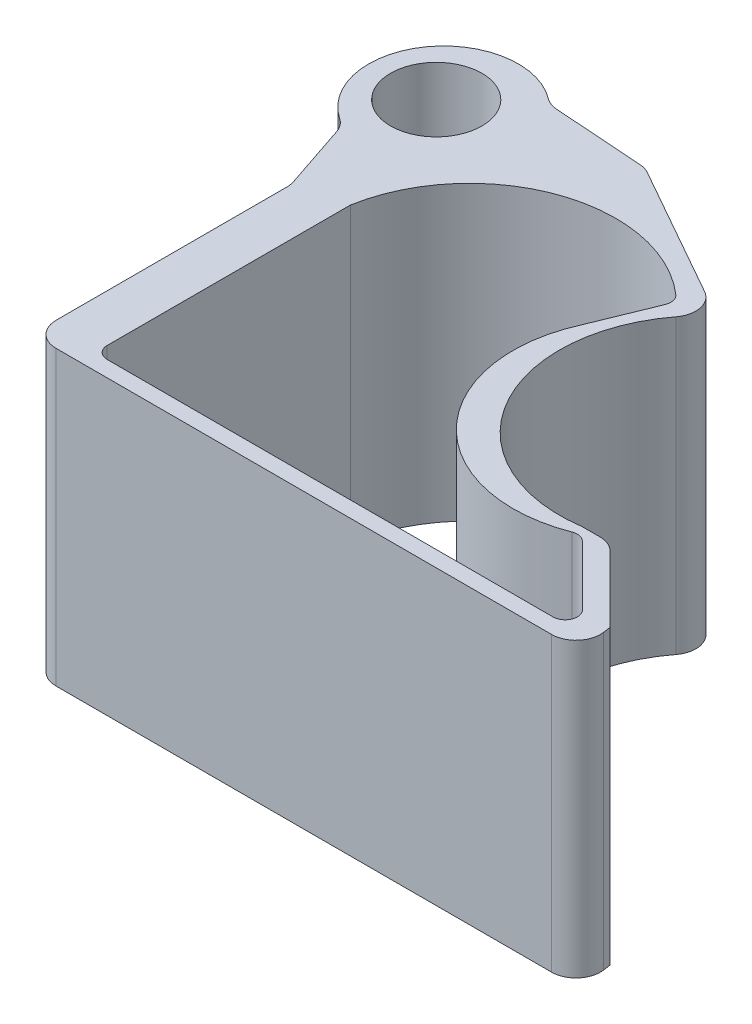
ISO-10303-21;
HEADER;
FILE_DESCRIPTION(('STEP AP214'),'2;1');
FILE_NAME('part.step','',(''),(''),'','','');
FILE_SCHEMA(('AUTOMOTIVE_DESIGN { 1 0 10303 214 1 1 1 1 }'));
ENDSEC;
DATA;
#1=APPLICATION_CONTEXT('core data for automotive mechanical design processes');
#2=APPLICATION_PROTOCOL_DEFINITION('international standard','automotive_design',2000,#1);
#3=PRODUCT_CONTEXT('',#1,'mechanical');
#4=PRODUCT('Part','Part','',(#3));
#5=PRODUCT_RELATED_PRODUCT_CATEGORY('part','',(#4));
#6=PRODUCT_DEFINITION_FORMATION('','',#4);
#7=PRODUCT_DEFINITION_CONTEXT('part definition',#1,'design');
#8=PRODUCT_DEFINITION('design','',#6,#7);
#9=PRODUCT_DEFINITION_SHAPE('','',#8);
#10=(LENGTH_UNIT() NAMED_UNIT(*) SI_UNIT(.MILLI.,.METRE.));
#11=(NAMED_UNIT(*) PLANE_ANGLE_UNIT() SI_UNIT($,.RADIAN.));
#12=(NAMED_UNIT(*) SI_UNIT($,.STERADIAN.) SOLID_ANGLE_UNIT());
#13=UNCERTAINTY_MEASURE_WITH_UNIT(LENGTH_MEASURE(1.E-05),#10,'distance_accuracy_value','');
#14=(GEOMETRIC_REPRESENTATION_CONTEXT(3) GLOBAL_UNCERTAINTY_ASSIGNED_CONTEXT((#13)) GLOBAL_UNIT_ASSIGNED_CONTEXT((#10,
#11,#12)) REPRESENTATION_CONTEXT('',''));
#15=CARTESIAN_POINT('',(0.,0.,0.));
#16=DIRECTION('',(0.,0.,1.));
#17=DIRECTION('',(1.,0.,0.));
#18=AXIS2_PLACEMENT_3D('',#15,#16,#17);
#19=CARTESIAN_POINT('',(4.18471702720005,30.48,1.7044667519984));
#20=DIRECTION('',(-0.926124676903562,0.,-0.377217553714397));
#21=DIRECTION('',(-0.377217553714397,0.,0.926124676903562));
#22=AXIS2_PLACEMENT_3D('',#19,#20,#21);
#23=PLANE('',#22);
#24=DIRECTION('',(0.377217553714397,0.,-0.926124676903562));
#25=VECTOR('',#24,1.);
#26=CARTESIAN_POINT('',(4.18471702720005,0.,1.7044667519984));
#27=LINE('',#26,#25);
#28=CARTESIAN_POINT('',(16.2026689249602,0.,-27.8013759871829));
#29=VERTEX_POINT('',#28);
#30=CARTESIAN_POINT('',(18.7462308393611,0.,-34.0461952777038));
#31=VERTEX_POINT('',#30);
#32=EDGE_CURVE('E337',#29,#31,#27,.T.);
#33=ORIENTED_EDGE('',*,*,#32,.F.);
#34=DIRECTION('',(0.,-1.,0.));
#35=VECTOR('',#34,1.);
#36=CARTESIAN_POINT('',(16.2026689249602,30.48,-27.8013759871829));
#37=LINE('',#36,#35);
#38=CARTESIAN_POINT('',(16.2026689249602,30.48,-27.8013759871829));
#39=VERTEX_POINT('',#38);
#40=EDGE_CURVE('E386',#39,#29,#37,.T.);
#41=ORIENTED_EDGE('',*,*,#40,.F.);
#42=DIRECTION('',(0.377217553714397,0.,-0.926124676903562));
#43=VECTOR('',#42,1.);
#44=CARTESIAN_POINT('',(4.18471702720005,30.48,1.7044667519984));
#45=LINE('',#44,#43);
#46=CARTESIAN_POINT('',(18.7462308393611,30.48,-34.0461952777038));
#47=VERTEX_POINT('',#46);
#48=EDGE_CURVE('E281',#39,#47,#45,.T.);
#49=ORIENTED_EDGE('',*,*,#48,.T.);
#50=DIRECTION('',(0.,-1.,0.));
#51=VECTOR('',#50,1.);
#52=CARTESIAN_POINT('',(18.7462308393611,30.48,-34.0461952777038));
#53=LINE('',#52,#51);
#54=EDGE_CURVE('E236',#47,#31,#53,.T.);
#55=ORIENTED_EDGE('',*,*,#54,.T.);
#56=EDGE_LOOP('',(#33,#41,#49,#55));
#57=FACE_BOUND('',#56,.T.);
#58=ADVANCED_FACE('F38',(#57),#23,.T.);
#59=CARTESIAN_POINT('',(29.2464173163576,30.48,-21.971));
#60=DIRECTION('',(0.,-1.,0.));
#61=DIRECTION('',(0.,0.,-1.));
#62=AXIS2_PLACEMENT_3D('',#59,#60,#61);
#63=CYLINDRICAL_SURFACE('',#62,14.2875);
#64=CARTESIAN_POINT('',(29.2464173163576,0.,-21.971));
#65=DIRECTION('',(0.,1.,0.));
#66=DIRECTION('',(0.,0.,1.));
#67=AXIS2_PLACEMENT_3D('',#64,#65,#66);
#68=CIRCLE('',#67,14.2875);
#69=CARTESIAN_POINT('',(34.4186080856135,0.,-8.65255043196006));
#70=VERTEX_POINT('',#69);
#71=EDGE_CURVE('E340',#29,#70,#68,.T.);
#72=ORIENTED_EDGE('',*,*,#71,.T.);
#73=DIRECTION('',(0.,-1.,0.));
#74=VECTOR('',#73,1.);
#75=CARTESIAN_POINT('',(34.4186080856135,30.48,-8.65255043196006));
#76=LINE('',#75,#74);
#77=CARTESIAN_POINT('',(34.4186080856135,30.48,-8.65255043196006));
#78=VERTEX_POINT('',#77);
#79=EDGE_CURVE('E383',#78,#70,#76,.T.);
#80=ORIENTED_EDGE('',*,*,#79,.F.);
#81=CARTESIAN_POINT('',(29.2464173163576,30.48,-21.971));
#82=DIRECTION('',(0.,1.,0.));
#83=DIRECTION('',(0.,0.,1.));
#84=AXIS2_PLACEMENT_3D('',#81,#82,#83);
#85=CIRCLE('',#84,14.2875);
#86=EDGE_CURVE('E284',#39,#78,#85,.T.);
#87=ORIENTED_EDGE('',*,*,#86,.F.);
#88=ORIENTED_EDGE('',*,*,#40,.T.);
#89=EDGE_LOOP('',(#72,#80,#87,#88));
#90=FACE_BOUND('',#89,.T.);
#91=ADVANCED_FACE('F488',(#90),#63,.T.);
#92=CARTESIAN_POINT('',(34.878358376214,30.48,-7.46868824813428));
#93=DIRECTION('',(0.,-1.,0.));
#94=DIRECTION('',(0.,0.,-1.));
#95=AXIS2_PLACEMENT_3D('',#92,#93,#94);
#96=CYLINDRICAL_SURFACE('',#95,1.27000000000001);
#97=CARTESIAN_POINT('',(34.878358376214,0.,-7.46868824813428));
#98=DIRECTION('',(0.,1.,0.));
#99=DIRECTION('',(0.,0.,1.));
#100=AXIS2_PLACEMENT_3D('',#97,#98,#99);
#101=CIRCLE('',#100,1.27000000000001);
#102=CARTESIAN_POINT('',(35.7753654293317,0.,-8.36773126526816));
#103=VERTEX_POINT('',#102);
#104=EDGE_CURVE('E343',#70,#103,#101,.F.);
#105=ORIENTED_EDGE('',*,*,#104,.T.);
#106=DIRECTION('',(0.,-1.,0.));
#107=VECTOR('',#106,1.);
#108=CARTESIAN_POINT('',(35.7753654293317,30.48,-8.36773126526816));
#109=LINE('',#108,#107);
#110=CARTESIAN_POINT('',(35.7753654293317,30.48,-8.36773126526816));
#111=VERTEX_POINT('',#110);
#112=EDGE_CURVE('E380',#111,#103,#109,.T.);
#113=ORIENTED_EDGE('',*,*,#112,.F.);
#114=CARTESIAN_POINT('',(34.878358376214,30.48,-7.46868824813428));
#115=DIRECTION('',(0.,1.,0.));
#116=DIRECTION('',(0.,0.,1.));
#117=AXIS2_PLACEMENT_3D('',#114,#115,#116);
#118=CIRCLE('',#117,1.27000000000001);
#119=EDGE_CURVE('E287',#78,#111,#118,.F.);
#120=ORIENTED_EDGE('',*,*,#119,.F.);
#121=ORIENTED_EDGE('',*,*,#79,.T.);
#122=EDGE_LOOP('',(#105,#113,#120,#121));
#123=FACE_BOUND('',#122,.T.);
#124=ADVANCED_FACE('F494',(#123),#96,.F.);
#125=CARTESIAN_POINT('',(22.0309834563949,30.48,-22.0809878453274));
#126=DIRECTION('',(0.706304766234372,0.,-0.70790788750699));
#127=DIRECTION('',(-0.70790788750699,0.,-0.706304766234372));
#128=AXIS2_PLACEMENT_3D('',#125,#126,#127);
#129=PLANE('',#128);
#130=DIRECTION('',(0.70790788750699,0.,0.706304766234372));
#131=VECTOR('',#130,1.);
#132=CARTESIAN_POINT('',(22.0309834563949,0.,-22.0809878453274));
#133=LINE('',#132,#131);
#134=CARTESIAN_POINT('',(41.9881230275086,0.,-2.16904301713387));
#135=VERTEX_POINT('',#134);
#136=EDGE_CURVE('E346',#103,#135,#133,.T.);
#137=ORIENTED_EDGE('',*,*,#136,.T.);
#138=DIRECTION('',(0.,-1.,0.));
#139=VECTOR('',#138,1.);
#140=CARTESIAN_POINT('',(41.9881230275086,30.48,-2.16904301713387));
#141=LINE('',#140,#139);
#142=CARTESIAN_POINT('',(41.9881230275086,30.48,-2.16904301713387));
#143=VERTEX_POINT('',#142);
#144=EDGE_CURVE('E377',#143,#135,#141,.T.);
#145=ORIENTED_EDGE('',*,*,#144,.F.);
#146=DIRECTION('',(0.70790788750699,0.,0.706304766234372));
#147=VECTOR('',#146,1.);
#148=CARTESIAN_POINT('',(22.0309834563949,30.48,-22.0809878453274));
#149=LINE('',#148,#147);
#150=EDGE_CURVE('E290',#111,#143,#149,.T.);
#151=ORIENTED_EDGE('',*,*,#150,.F.);
#152=ORIENTED_EDGE('',*,*,#112,.T.);
#153=EDGE_LOOP('',(#137,#145,#151,#152));
#154=FACE_BOUND('',#153,.T.);
#155=ADVANCED_FACE('F771',(#154),#129,.F.);
#156=CARTESIAN_POINT('',(41.0911159743909,30.48,-1.27000000000001));
#157=DIRECTION('',(0.,-1.,0.));
#158=DIRECTION('',(0.,0.,-1.));
#159=AXIS2_PLACEMENT_3D('',#156,#157,#158);
#160=CYLINDRICAL_SURFACE('',#159,1.27);
#161=CARTESIAN_POINT('',(41.0911159743909,0.,-1.27000000000001));
#162=DIRECTION('',(0.,1.,0.));
#163=DIRECTION('',(0.,0.,1.));
#164=AXIS2_PLACEMENT_3D('',#161,#162,#163);
#165=CIRCLE('',#164,1.27);
#166=CARTESIAN_POINT('',(41.0911159743909,0.,0.));
#167=VERTEX_POINT('',#166);
#168=EDGE_CURVE('E349',#135,#167,#165,.F.);
#169=ORIENTED_EDGE('',*,*,#168,.T.);
#170=DIRECTION('',(0.,-1.,0.));
#171=VECTOR('',#170,1.);
#172=CARTESIAN_POINT('',(41.0911159743909,30.48,0.));
#173=LINE('',#172,#171);
#174=CARTESIAN_POINT('',(41.0911159743909,30.48,0.));
#175=VERTEX_POINT('',#174);
#176=EDGE_CURVE('E374',#175,#167,#173,.T.);
#177=ORIENTED_EDGE('',*,*,#176,.F.);
#178=CARTESIAN_POINT('',(41.0911159743909,30.48,-1.27000000000001));
#179=DIRECTION('',(0.,1.,0.));
#180=DIRECTION('',(0.,0.,1.));
#181=AXIS2_PLACEMENT_3D('',#178,#179,#180);
#182=CIRCLE('',#181,1.27);
#183=EDGE_CURVE('E293',#143,#175,#182,.F.);
#184=ORIENTED_EDGE('',*,*,#183,.F.);
#185=ORIENTED_EDGE('',*,*,#144,.T.);
#186=EDGE_LOOP('',(#169,#177,#184,#185));
#187=FACE_BOUND('',#186,.T.);
#188=ADVANCED_FACE('F763',(#187),#160,.F.);
#189=CARTESIAN_POINT('',(0.,30.48,0.));
#190=DIRECTION('',(0.,0.,1.));
#191=DIRECTION('',(1.,0.,0.));
#192=AXIS2_PLACEMENT_3D('',#189,#190,#191);
#193=PLANE('',#192);
#194=DIRECTION('',(-1.,0.,0.));
#195=VECTOR('',#194,1.);
#196=CARTESIAN_POINT('',(0.,0.,0.));
#197=LINE('',#196,#195);
#198=CARTESIAN_POINT('',(-5.36791081287254,0.,0.));
#199=VERTEX_POINT('',#198);
#200=EDGE_CURVE('E352',#167,#199,#197,.T.);
#201=ORIENTED_EDGE('',*,*,#200,.T.);
#202=DIRECTION('',(0.,-1.,0.));
#203=VECTOR('',#202,1.);
#204=CARTESIAN_POINT('',(-5.36791081287254,30.48,0.));
#205=LINE('',#204,#203);
#206=CARTESIAN_POINT('',(-5.36791081287254,30.48,0.));
#207=VERTEX_POINT('',#206);
#208=EDGE_CURVE('E372',#207,#199,#205,.T.);
#209=ORIENTED_EDGE('',*,*,#208,.F.);
#210=DIRECTION('',(-1.,0.,0.));
#211=VECTOR('',#210,1.);
#212=CARTESIAN_POINT('',(0.,30.48,0.));
#213=LINE('',#212,#211);
#214=EDGE_CURVE('E296',#175,#207,#213,.T.);
#215=ORIENTED_EDGE('',*,*,#214,.F.);
#216=ORIENTED_EDGE('',*,*,#176,.T.);
#217=EDGE_LOOP('',(#201,#209,#215,#216));
#218=FACE_BOUND('',#217,.T.);
#219=ADVANCED_FACE('F755',(#218),#193,.F.);
#220=CARTESIAN_POINT('',(-5.36791081287255,30.48,-1.27000000000001));
#221=DIRECTION('',(0.,-1.,0.));
#222=DIRECTION('',(0.,0.,-1.));
#223=AXIS2_PLACEMENT_3D('',#220,#221,#222);
#224=CYLINDRICAL_SURFACE('',#223,1.27);
#225=CARTESIAN_POINT('',(-5.36791081287255,0.,-1.27000000000001));
#226=DIRECTION('',(0.,1.,0.));
#227=DIRECTION('',(0.,0.,1.));
#228=AXIS2_PLACEMENT_3D('',#225,#226,#227);
#229=CIRCLE('',#228,1.27);
#230=CARTESIAN_POINT('',(-6.63791081287255,0.,-1.27));
#231=VERTEX_POINT('',#230);
#232=EDGE_CURVE('E355',#231,#199,#229,.T.);
#233=ORIENTED_EDGE('',*,*,#232,.F.);
#234=DIRECTION('',(0.,-1.,0.));
#235=VECTOR('',#234,1.);
#236=CARTESIAN_POINT('',(-6.63791081287255,30.48,-1.27));
#237=LINE('',#236,#235);
#238=CARTESIAN_POINT('',(-6.63791081287255,30.48,-1.27));
#239=VERTEX_POINT('',#238);
#240=EDGE_CURVE('E370',#239,#231,#237,.T.);
#241=ORIENTED_EDGE('',*,*,#240,.F.);
#242=CARTESIAN_POINT('',(-5.36791081287255,30.48,-1.27000000000001));
#243=DIRECTION('',(0.,1.,0.));
#244=DIRECTION('',(0.,0.,1.));
#245=AXIS2_PLACEMENT_3D('',#242,#243,#244);
#246=CIRCLE('',#245,1.27);
#247=EDGE_CURVE('E298',#239,#207,#246,.T.);
#248=ORIENTED_EDGE('',*,*,#247,.T.);
#249=ORIENTED_EDGE('',*,*,#208,.T.);
#250=EDGE_LOOP('',(#233,#241,#248,#249));
#251=FACE_BOUND('',#250,.T.);
#252=ADVANCED_FACE('F747',(#251),#224,.F.);
#253=CARTESIAN_POINT('',(-6.63791081287255,30.48,0.));
#254=DIRECTION('',(-1.,0.,0.));
#255=DIRECTION('',(0.,0.,1.));
#256=AXIS2_PLACEMENT_3D('',#253,#254,#255);
#257=PLANE('',#256);
#258=DIRECTION('',(0.,0.,-1.));
#259=VECTOR('',#258,1.);
#260=CARTESIAN_POINT('',(-6.63791081287255,0.,0.));
#261=LINE('',#260,#259);
#262=CARTESIAN_POINT('',(-6.63791081287255,0.,-26.6076118719117));
#263=VERTEX_POINT('',#262);
#264=EDGE_CURVE('E358',#231,#263,#261,.T.);
#265=ORIENTED_EDGE('',*,*,#264,.T.);
#266=DIRECTION('',(0.,-1.,0.));
#267=VECTOR('',#266,1.);
#268=CARTESIAN_POINT('',(-6.63791081287255,30.48,-26.6076118719117));
#269=LINE('',#268,#267);
#270=CARTESIAN_POINT('',(-6.63791081287255,30.48,-26.6076118719117));
#271=VERTEX_POINT('',#270);
#272=EDGE_CURVE('E367',#271,#263,#269,.T.);
#273=ORIENTED_EDGE('',*,*,#272,.F.);
#274=DIRECTION('',(0.,0.,-1.));
#275=VECTOR('',#274,1.);
#276=CARTESIAN_POINT('',(-6.63791081287255,30.48,0.));
#277=LINE('',#276,#275);
#278=EDGE_CURVE('E301',#239,#271,#277,.T.);
#279=ORIENTED_EDGE('',*,*,#278,.F.);
#280=ORIENTED_EDGE('',*,*,#240,.T.);
#281=EDGE_LOOP('',(#265,#273,#279,#280));
#282=FACE_BOUND('',#281,.T.);
#283=ADVANCED_FACE('F740',(#282),#257,.F.);
#284=CARTESIAN_POINT('',(8.37824924748507,30.48,-24.0052020191556));
#285=DIRECTION('',(0.,-1.,0.));
#286=DIRECTION('',(0.,0.,-1.));
#287=AXIS2_PLACEMENT_3D('',#284,#285,#286);
#288=CYLINDRICAL_SURFACE('',#287,15.24);
#289=CARTESIAN_POINT('',(8.37824924748507,0.,-24.0052020191556));
#290=DIRECTION('',(0.,1.,0.));
#291=DIRECTION('',(0.,0.,1.));
#292=AXIS2_PLACEMENT_3D('',#289,#290,#291);
#293=CIRCLE('',#292,15.24);
#294=CARTESIAN_POINT('',(18.4056709771671,0.,-35.4816306210815));
#295=VERTEX_POINT('',#294);
#296=EDGE_CURVE('E255',#263,#295,#293,.F.);
#297=ORIENTED_EDGE('',*,*,#296,.T.);
#298=DIRECTION('',(0.,-1.,0.));
#299=VECTOR('',#298,1.);
#300=CARTESIAN_POINT('',(18.4056709771671,30.48,-35.4816306210815));
#301=LINE('',#300,#299);
#302=CARTESIAN_POINT('',(18.4056709771671,30.48,-35.4816306210815));
#303=VERTEX_POINT('',#302);
#304=EDGE_CURVE('E364',#303,#295,#301,.T.);
#305=ORIENTED_EDGE('',*,*,#304,.F.);
#306=CARTESIAN_POINT('',(8.37824924748507,30.48,-24.0052020191556));
#307=DIRECTION('',(0.,1.,0.));
#308=DIRECTION('',(0.,0.,1.));
#309=AXIS2_PLACEMENT_3D('',#306,#307,#308);
#310=CIRCLE('',#309,15.24);
#311=EDGE_CURVE('E304',#271,#303,#310,.F.);
#312=ORIENTED_EDGE('',*,*,#311,.F.);
#313=ORIENTED_EDGE('',*,*,#272,.T.);
#314=EDGE_LOOP('',(#297,#305,#312,#313));
#315=FACE_BOUND('',#314,.T.);
#316=ADVANCED_FACE('F535',(#315),#288,.F.);
#317=CARTESIAN_POINT('',(44.4373342424928,30.48,-6.14174538310747));
#318=DIRECTION('',(0.990583502378702,0.,-0.136909914962881));
#319=DIRECTION('',(-0.136909914962881,0.,-0.990583502378702));
#320=AXIS2_PLACEMENT_3D('',#317,#318,#319);
#321=PLANE('',#320);
#322=DIRECTION('',(0.136909914962881,0.,0.990583502378703));
#323=VECTOR('',#322,1.);
#324=CARTESIAN_POINT('',(44.4373342424928,30.48,-6.14174538310747));
#325=LINE('',#324,#323);
#326=CARTESIAN_POINT('',(45.0059464364585,30.48,-2.02766892088412));
#327=VERTEX_POINT('',#326);
#328=CARTESIAN_POINT('',(45.1160308623361,30.48,-1.23117572188713));
#329=VERTEX_POINT('',#328);
#330=EDGE_CURVE('E229',#327,#329,#325,.T.);
#331=ORIENTED_EDGE('',*,*,#330,.T.);
#332=DIRECTION('',(0.,-1.,0.));
#333=VECTOR('',#332,1.);
#334=CARTESIAN_POINT('',(45.1160308623361,0.,-1.23117572188714));
#335=LINE('',#334,#333);
#336=CARTESIAN_POINT('',(45.1160308623361,0.,-1.23117572188713));
#337=VERTEX_POINT('',#336);
#338=EDGE_CURVE('E437',#329,#337,#335,.T.);
#339=ORIENTED_EDGE('',*,*,#338,.T.);
#340=DIRECTION('',(0.136909914962881,0.,0.990583502378703));
#341=VECTOR('',#340,1.);
#342=CARTESIAN_POINT('',(44.4373342424928,0.,-6.14174538310747));
#343=LINE('',#342,#341);
#344=CARTESIAN_POINT('',(45.0059464364585,0.,-2.02766892088412));
#345=VERTEX_POINT('',#344);
#346=EDGE_CURVE('E232',#345,#337,#343,.T.);
#347=ORIENTED_EDGE('',*,*,#346,.F.);
#348=DIRECTION('',(0.,-1.,0.));
#349=VECTOR('',#348,1.);
#350=CARTESIAN_POINT('',(45.0059464364585,30.48,-2.02766892088412));
#351=LINE('',#350,#349);
#352=EDGE_CURVE('E224',#327,#345,#351,.T.);
#353=ORIENTED_EDGE('',*,*,#352,.F.);
#354=EDGE_LOOP('',(#331,#339,#347,#353));
#355=FACE_BOUND('',#354,.T.);
#356=ADVANCED_FACE('F226',(#355),#321,.T.);
#357=CARTESIAN_POINT('',(23.5168076786708,30.48,-23.5168076786714));
#358=DIRECTION('',(-0.707106781186539,0.,0.707106781186556));
#359=DIRECTION('',(0.707106781186556,0.,0.707106781186539));
#360=AXIS2_PLACEMENT_3D('',#357,#358,#359);
#361=PLANE('',#360);
#362=DIRECTION('',(-0.707106781186556,0.,-0.707106781186539));
#363=VECTOR('',#362,1.);
#364=CARTESIAN_POINT('',(23.5168076786708,0.,-23.5168076786714));
#365=LINE('',#364,#363);
#366=CARTESIAN_POINT('',(38.1118275889465,0.,-8.92178776839598));
#367=VERTEX_POINT('',#366);
#368=EDGE_CURVE('E310',#345,#367,#365,.T.);
#369=ORIENTED_EDGE('',*,*,#368,.T.);
#370=DIRECTION('',(0.,-1.,0.));
#371=VECTOR('',#370,1.);
#372=CARTESIAN_POINT('',(38.1118275889465,30.48,-8.92178776839598));
#373=LINE('',#372,#371);
#374=CARTESIAN_POINT('',(38.1118275889465,30.48,-8.92178776839598));
#375=VERTEX_POINT('',#374);
#376=EDGE_CURVE('E243',#367,#375,#373,.F.);
#377=ORIENTED_EDGE('',*,*,#376,.T.);
#378=DIRECTION('',(-0.707106781186556,0.,-0.707106781186539));
#379=VECTOR('',#378,1.);
#380=CARTESIAN_POINT('',(23.5168076786708,30.48,-23.5168076786714));
#381=LINE('',#380,#379);
#382=EDGE_CURVE('E240',#327,#375,#381,.T.);
#383=ORIENTED_EDGE('',*,*,#382,.F.);
#384=ORIENTED_EDGE('',*,*,#352,.T.);
#385=EDGE_LOOP('',(#369,#377,#383,#384));
#386=FACE_BOUND('',#385,.T.);
#387=ADVANCED_FACE('F241',(#386),#361,.F.);
#388=CARTESIAN_POINT('',(0.,30.48,-9.66573654418213));
#389=DIRECTION('',(0.,0.,-1.));
#390=DIRECTION('',(-1.,0.,0.));
#391=AXIS2_PLACEMENT_3D('',#388,#389,#390);
#392=PLANE('',#391);
#393=DIRECTION('',(1.,0.,0.));
#394=VECTOR('',#393,1.);
#395=CARTESIAN_POINT('',(0.,30.48,-9.66573654418213));
#396=LINE('',#395,#394);
#397=CARTESIAN_POINT('',(34.4324645893046,30.48,-9.66573654418213));
#398=VERTEX_POINT('',#397);
#399=CARTESIAN_POINT('',(36.3157763647327,30.48,-9.66573654418213));
#400=VERTEX_POINT('',#399);
#401=EDGE_CURVE('E245',#398,#400,#396,.T.);
#402=ORIENTED_EDGE('',*,*,#401,.T.);
#403=DIRECTION('',(0.,-1.,0.));
#404=VECTOR('',#403,1.);
#405=CARTESIAN_POINT('',(36.3157763647327,0.,-9.66573654418213));
#406=LINE('',#405,#404);
#407=CARTESIAN_POINT('',(36.3157763647327,0.,-9.66573654418213));
#408=VERTEX_POINT('',#407);
#409=EDGE_CURVE('E439',#400,#408,#406,.T.);
#410=ORIENTED_EDGE('',*,*,#409,.T.);
#411=DIRECTION('',(1.,0.,0.));
#412=VECTOR('',#411,1.);
#413=CARTESIAN_POINT('',(0.,0.,-9.66573654418213));
#414=LINE('',#413,#412);
#415=CARTESIAN_POINT('',(34.4324645893046,0.,-9.66573654418213));
#416=VERTEX_POINT('',#415);
#417=EDGE_CURVE('E312',#416,#408,#414,.T.);
#418=ORIENTED_EDGE('',*,*,#417,.F.);
#419=DIRECTION('',(0.,-1.,0.));
#420=VECTOR('',#419,1.);
#421=CARTESIAN_POINT('',(34.4324645893046,30.48,-9.66573654418213));
#422=LINE('',#421,#420);
#423=EDGE_CURVE('E237',#398,#416,#422,.T.);
#424=ORIENTED_EDGE('',*,*,#423,.F.);
#425=EDGE_LOOP('',(#402,#410,#418,#424));
#426=FACE_BOUND('',#425,.T.);
#427=ADVANCED_FACE('F526',(#426),#392,.T.);
#428=CARTESIAN_POINT('',(32.2505436508209,30.48,-24.4205987681199));
#429=DIRECTION('',(0.,-1.,0.));
#430=DIRECTION('',(0.,0.,-1.));
#431=AXIS2_PLACEMENT_3D('',#428,#429,#430);
#432=CYLINDRICAL_SURFACE('',#431,14.9153189114138);
#433=CARTESIAN_POINT('',(32.2505436508209,0.,-24.4205987681199));
#434=DIRECTION('',(0.,1.,0.));
#435=DIRECTION('',(0.,0.,1.));
#436=AXIS2_PLACEMENT_3D('',#433,#434,#435);
#437=CIRCLE('',#436,14.9153189114138);
#438=CARTESIAN_POINT('',(20.4121143022565,0.,-33.4935436477181));
#439=VERTEX_POINT('',#438);
#440=EDGE_CURVE('E315',#439,#416,#437,.T.);
#441=ORIENTED_EDGE('',*,*,#440,.F.);
#442=DIRECTION('',(0.,-1.,0.));
#443=VECTOR('',#442,1.);
#444=CARTESIAN_POINT('',(20.4121143022565,30.48,-33.4935436477181));
#445=LINE('',#444,#443);
#446=CARTESIAN_POINT('',(20.4121143022565,30.48,-33.4935436477181));
#447=VERTEX_POINT('',#446);
#448=EDGE_CURVE('E443',#439,#447,#445,.F.);
#449=ORIENTED_EDGE('',*,*,#448,.T.);
#450=CARTESIAN_POINT('',(32.2505436508209,30.48,-24.4205987681199));
#451=DIRECTION('',(0.,1.,0.));
#452=DIRECTION('',(0.,0.,1.));
#453=AXIS2_PLACEMENT_3D('',#450,#451,#452);
#454=CIRCLE('',#453,14.9153189114138);
#455=EDGE_CURVE('E260',#447,#398,#454,.T.);
#456=ORIENTED_EDGE('',*,*,#455,.T.);
#457=ORIENTED_EDGE('',*,*,#423,.T.);
#458=EDGE_LOOP('',(#441,#449,#456,#457));
#459=FACE_BOUND('',#458,.T.);
#460=ADVANCED_FACE('F522',(#459),#432,.F.);
#461=CARTESIAN_POINT('',(20.704936309171,30.48,-36.651595329899));
#462=DIRECTION('',(0.491855910758137,0.,-0.870676612211609));
#463=DIRECTION('',(-0.870676612211609,0.,-0.491855910758137));
#464=AXIS2_PLACEMENT_3D('',#461,#462,#463);
#465=PLANE('',#464);
#466=DIRECTION('',(0.870676612211609,0.,0.491855910758137));
#467=VECTOR('',#466,1.);
#468=CARTESIAN_POINT('',(20.704936309171,0.,-36.651595329899));
#469=LINE('',#468,#467);
#470=CARTESIAN_POINT('',(5.8772231966423,0.,-45.0279525618889));
#471=VERTEX_POINT('',#470);
#472=CARTESIAN_POINT('',(19.6454063502494,0.,-37.2501368154652));
#473=VERTEX_POINT('',#472);
#474=EDGE_CURVE('E317',#471,#473,#469,.T.);
#475=ORIENTED_EDGE('',*,*,#474,.F.);
#476=DIRECTION('',(0.,-1.,0.));
#477=VECTOR('',#476,1.);
#478=CARTESIAN_POINT('',(5.87722319664231,30.48,-45.0279525618889));
#479=LINE('',#478,#477);
#480=CARTESIAN_POINT('',(5.8772231966423,30.48,-45.0279525618889));
#481=VERTEX_POINT('',#480);
#482=EDGE_CURVE('E408',#471,#481,#479,.F.);
#483=ORIENTED_EDGE('',*,*,#482,.T.);
#484=DIRECTION('',(0.870676612211609,0.,0.491855910758137));
#485=VECTOR('',#484,1.);
#486=CARTESIAN_POINT('',(20.704936309171,30.48,-36.651595329899));
#487=LINE('',#486,#485);
#488=CARTESIAN_POINT('',(19.6454063502494,30.48,-37.2501368154652));
#489=VERTEX_POINT('',#488);
#490=EDGE_CURVE('E262',#481,#489,#487,.T.);
#491=ORIENTED_EDGE('',*,*,#490,.T.);
#492=DIRECTION('',(0.,-1.,0.));
#493=VECTOR('',#492,1.);
#494=CARTESIAN_POINT('',(19.6454063502494,30.48,-37.2501368154652));
#495=LINE('',#494,#493);
#496=EDGE_CURVE('E405',#489,#473,#495,.T.);
#497=ORIENTED_EDGE('',*,*,#496,.T.);
#498=EDGE_LOOP('',(#475,#483,#491,#497));
#499=FACE_BOUND('',#498,.T.);
#500=ADVANCED_FACE('F518',(#499),#465,.T.);
#501=CARTESIAN_POINT('',(3.19047757066807,30.48,-45.4635547832303));
#502=DIRECTION('',(-0.0700044315641476,0.,0.997546680392141));
#503=DIRECTION('',(0.997546680392141,0.,0.0700044315641476));
#504=AXIS2_PLACEMENT_3D('',#501,#502,#503);
#505=PLANE('',#504);
#506=DIRECTION('',(-0.997546680392141,0.,-0.0700044315641476));
#507=VECTOR('',#506,1.);
#508=CARTESIAN_POINT('',(3.19047757066807,30.48,-45.4635547832303));
#509=LINE('',#508,#507);
#510=CARTESIAN_POINT('',(4.80572043948957,30.48,-45.3502025350674));
#511=VERTEX_POINT('',#510);
#512=CARTESIAN_POINT('',(-4.55359505856048,30.48,-46.0070074487111));
#513=VERTEX_POINT('',#512);
#514=EDGE_CURVE('E265',#511,#513,#509,.T.);
#515=ORIENTED_EDGE('',*,*,#514,.F.);
#516=DIRECTION('',(0.,-1.,0.));
#517=VECTOR('',#516,1.);
#518=CARTESIAN_POINT('',(4.80572043948957,0.,-45.3502025350674));
#519=LINE('',#518,#517);
#520=CARTESIAN_POINT('',(4.80572043948957,0.,-45.3502025350674));
#521=VERTEX_POINT('',#520);
#522=EDGE_CURVE('E392',#511,#521,#519,.T.);
#523=ORIENTED_EDGE('',*,*,#522,.T.);
#524=DIRECTION('',(-0.997546680392141,0.,-0.0700044315641476));
#525=VECTOR('',#524,1.);
#526=CARTESIAN_POINT('',(3.19047757066807,0.,-45.4635547832303));
#527=LINE('',#526,#525);
#528=CARTESIAN_POINT('',(-4.55359505856048,0.,-46.0070074487111));
#529=VERTEX_POINT('',#528);
#530=EDGE_CURVE('E320',#521,#529,#527,.T.);
#531=ORIENTED_EDGE('',*,*,#530,.T.);
#532=DIRECTION('',(0.,-1.,0.));
#533=VECTOR('',#532,1.);
#534=CARTESIAN_POINT('',(-4.55359505856048,30.48,-46.0070074487111));
#535=LINE('',#534,#533);
#536=EDGE_CURVE('E388',#529,#513,#535,.F.);
#537=ORIENTED_EDGE('',*,*,#536,.T.);
#538=EDGE_LOOP('',(#515,#523,#531,#537));
#539=FACE_BOUND('',#538,.T.);
#540=ADVANCED_FACE('F514',(#539),#505,.F.);
#541=CARTESIAN_POINT('',(-10.6285353230796,30.48,-40.3105128222524));
#542=DIRECTION('',(0.,-1.,0.));
#543=DIRECTION('',(0.,0.,-1.));
#544=AXIS2_PLACEMENT_3D('',#541,#542,#543);
#545=CYLINDRICAL_SURFACE('',#544,7.79605987950944);
#546=CARTESIAN_POINT('',(-10.6285353230796,30.48,-40.3105128222524));
#547=DIRECTION('',(0.,1.,0.));
#548=DIRECTION('',(0.,0.,1.));
#549=AXIS2_PLACEMENT_3D('',#546,#547,#548);
#550=CIRCLE('',#549,7.79605987950944);
#551=CARTESIAN_POINT('',(-14.9754848679476,30.48,-33.838837668224));
#552=VERTEX_POINT('',#551);
#553=CARTESIAN_POINT('',(-5.91234503052465,30.48,-46.5182578854221));
#554=VERTEX_POINT('',#553);
#555=EDGE_CURVE('E268',#552,#554,#550,.F.);
#556=ORIENTED_EDGE('',*,*,#555,.T.);
#557=DIRECTION('',(0.,-1.,0.));
#558=VECTOR('',#557,1.);
#559=CARTESIAN_POINT('',(-5.91234503052465,30.48,-46.5182578854221));
#560=LINE('',#559,#558);
#561=CARTESIAN_POINT('',(-5.91234503052465,0.,-46.5182578854221));
#562=VERTEX_POINT('',#561);
#563=EDGE_CURVE('E420',#554,#562,#560,.T.);
#564=ORIENTED_EDGE('',*,*,#563,.T.);
#565=CARTESIAN_POINT('',(-10.6285353230796,0.,-40.3105128222524));
#566=DIRECTION('',(0.,1.,0.));
#567=DIRECTION('',(0.,0.,1.));
#568=AXIS2_PLACEMENT_3D('',#565,#566,#567);
#569=CIRCLE('',#568,7.79605987950944);
#570=CARTESIAN_POINT('',(-14.9754848679476,0.,-33.838837668224));
#571=VERTEX_POINT('',#570);
#572=EDGE_CURVE('E323',#571,#562,#569,.F.);
#573=ORIENTED_EDGE('',*,*,#572,.F.);
#574=DIRECTION('',(0.,-1.,0.));
#575=VECTOR('',#574,1.);
#576=CARTESIAN_POINT('',(-14.9754848679476,30.48,-33.838837668224));
#577=LINE('',#576,#575);
#578=EDGE_CURVE('E418',#571,#552,#577,.F.);
#579=ORIENTED_EDGE('',*,*,#578,.T.);
#580=EDGE_LOOP('',(#556,#564,#573,#579));
#581=FACE_BOUND('',#580,.T.);
#582=ADVANCED_FACE('F511',(#581),#545,.T.);
#583=CARTESIAN_POINT('',(-2.75631457808083,30.48,0.924784682601662));
#584=DIRECTION('',(0.948060986863627,0.,-0.318088612162029));
#585=DIRECTION('',(-0.318088612162029,0.,-0.948060986863627));
#586=AXIS2_PLACEMENT_3D('',#583,#584,#585);
#587=PLANE('',#586);
#588=DIRECTION('',(0.318088612162029,0.,0.948060986863627));
#589=VECTOR('',#588,1.);
#590=CARTESIAN_POINT('',(-2.75631457808083,30.48,0.924784682601662));
#591=LINE('',#590,#589);
#592=CARTESIAN_POINT('',(-13.9836704845284,30.48,-32.5382747088922));
#593=VERTEX_POINT('',#592);
#594=CARTESIAN_POINT('',(-11.7075854820456,30.48,-25.7544185407245));
#595=VERTEX_POINT('',#594);
#596=EDGE_CURVE('E271',#593,#595,#591,.T.);
#597=ORIENTED_EDGE('',*,*,#596,.F.);
#598=DIRECTION('',(0.,-1.,0.));
#599=VECTOR('',#598,1.);
#600=CARTESIAN_POINT('',(-13.9836704845284,30.48,-32.5382747088922));
#601=LINE('',#600,#599);
#602=CARTESIAN_POINT('',(-13.9836704845284,0.,-32.5382747088922));
#603=VERTEX_POINT('',#602);
#604=EDGE_CURVE('E425',#593,#603,#601,.T.);
#605=ORIENTED_EDGE('',*,*,#604,.T.);
#606=DIRECTION('',(0.318088612162029,0.,0.948060986863627));
#607=VECTOR('',#606,1.);
#608=CARTESIAN_POINT('',(-2.75631457808083,0.,0.924784682601662));
#609=LINE('',#608,#607);
#610=CARTESIAN_POINT('',(-11.7075854820456,0.,-25.7544185407245));
#611=VERTEX_POINT('',#610);
#612=EDGE_CURVE('E326',#603,#611,#609,.T.);
#613=ORIENTED_EDGE('',*,*,#612,.T.);
#614=DIRECTION('',(0.,-1.,0.));
#615=VECTOR('',#614,1.);
#616=CARTESIAN_POINT('',(-11.7075854820456,30.48,-25.7544185407245));
#617=LINE('',#616,#615);
#618=EDGE_CURVE('E423',#611,#595,#617,.F.);
#619=ORIENTED_EDGE('',*,*,#618,.T.);
#620=EDGE_LOOP('',(#597,#605,#613,#619));
#621=FACE_BOUND('',#620,.T.);
#622=ADVANCED_FACE('F463',(#621),#587,.F.);
#623=CARTESIAN_POINT('',(-11.5756603886792,30.48,0.));
#624=DIRECTION('',(1.,0.,0.));
#625=DIRECTION('',(0.,0.,-1.));
#626=AXIS2_PLACEMENT_3D('',#623,#624,#625);
#627=PLANE('',#626);
#628=DIRECTION('',(0.,0.,1.));
#629=VECTOR('',#628,1.);
#630=CARTESIAN_POINT('',(-11.5756603886792,30.48,0.));
#631=LINE('',#630,#629);
#632=CARTESIAN_POINT('',(-11.5756603886792,30.48,-24.946473465833));
#633=VERTEX_POINT('',#632);
#634=CARTESIAN_POINT('',(-11.5756603886792,30.48,-0.883424537881416));
#635=VERTEX_POINT('',#634);
#636=EDGE_CURVE('E274',#633,#635,#631,.T.);
#637=ORIENTED_EDGE('',*,*,#636,.F.);
#638=DIRECTION('',(0.,-1.,0.));
#639=VECTOR('',#638,1.);
#640=CARTESIAN_POINT('',(-11.5756603886792,0.,-24.946473465833));
#641=LINE('',#640,#639);
#642=CARTESIAN_POINT('',(-11.5756603886792,0.,-24.946473465833));
#643=VERTEX_POINT('',#642);
#644=EDGE_CURVE('E430',#633,#643,#641,.T.);
#645=ORIENTED_EDGE('',*,*,#644,.T.);
#646=DIRECTION('',(0.,0.,1.));
#647=VECTOR('',#646,1.);
#648=CARTESIAN_POINT('',(-11.5756603886792,0.,0.));
#649=LINE('',#648,#647);
#650=CARTESIAN_POINT('',(-11.5756603886792,0.,-0.883424537881416));
#651=VERTEX_POINT('',#650);
#652=EDGE_CURVE('E329',#643,#651,#649,.T.);
#653=ORIENTED_EDGE('',*,*,#652,.T.);
#654=DIRECTION('',(0.,-1.,0.));
#655=VECTOR('',#654,1.);
#656=CARTESIAN_POINT('',(-11.5756603886792,30.48,-0.883424537881416));
#657=LINE('',#656,#655);
#658=EDGE_CURVE('E428',#651,#635,#657,.F.);
#659=ORIENTED_EDGE('',*,*,#658,.T.);
#660=EDGE_LOOP('',(#637,#645,#653,#659));
#661=FACE_BOUND('',#660,.T.);
#662=ADVANCED_FACE('F469',(#661),#627,.F.);
#663=CARTESIAN_POINT('',(-11.6788357549777,30.48,-40.5983516773079));
#664=DIRECTION('',(0.,-1.,0.));
#665=DIRECTION('',(0.,0.,-1.));
#666=AXIS2_PLACEMENT_3D('',#663,#664,#665);
#667=CYLINDRICAL_SURFACE('',#666,4.76249999999999);
#668=CARTESIAN_POINT('',(-11.6788357549777,30.48,-40.5983516773079));
#669=DIRECTION('',(0.,1.,0.));
#670=DIRECTION('',(0.,0.,1.));
#671=AXIS2_PLACEMENT_3D('',#668,#669,#670);
#672=CIRCLE('',#671,4.76249999999999);
#673=CARTESIAN_POINT('',(-11.6788357549777,30.48,-35.8358516773079));
#674=VERTEX_POINT('',#673);
#675=EDGE_CURVE('E278',#674,#674,#672,.T.);
#676=ORIENTED_EDGE('',*,*,#675,.T.);
#677=EDGE_LOOP('',(#676));
#678=FACE_BOUND('',#677,.T.);
#679=CARTESIAN_POINT('',(-11.6788357549777,0.,-40.5983516773079));
#680=DIRECTION('',(0.,1.,0.));
#681=DIRECTION('',(0.,0.,1.));
#682=AXIS2_PLACEMENT_3D('',#679,#680,#681);
#683=CIRCLE('',#682,4.76249999999999);
#684=CARTESIAN_POINT('',(-11.6788357549777,0.,-35.8358516773079));
#685=VERTEX_POINT('',#684);
#686=EDGE_CURVE('E334',#685,#685,#683,.T.);
#687=ORIENTED_EDGE('',*,*,#686,.F.);
#688=EDGE_LOOP('',(#687));
#689=FACE_BOUND('',#688,.T.);
#690=ADVANCED_FACE('F500',(#678,#689),#667,.F.);
#691=CARTESIAN_POINT('',(0.,30.48,1.65657546211858));
#692=DIRECTION('',(0.,0.,-1.));
#693=DIRECTION('',(-1.,0.,0.));
#694=AXIS2_PLACEMENT_3D('',#691,#692,#693);
#695=PLANE('',#694);
#696=DIRECTION('',(1.,0.,0.));
#697=VECTOR('',#696,1.);
#698=CARTESIAN_POINT('',(0.,30.48,1.65657546211858));
#699=LINE('',#698,#697);
#700=CARTESIAN_POINT('',(-9.03566038867925,30.48,1.65657546211858));
#701=VERTEX_POINT('',#700);
#702=CARTESIAN_POINT('',(42.5999487662942,30.48,1.65657546211858));
#703=VERTEX_POINT('',#702);
#704=EDGE_CURVE('E276',#701,#703,#699,.T.);
#705=ORIENTED_EDGE('',*,*,#704,.F.);
#706=DIRECTION('',(0.,-1.,0.));
#707=VECTOR('',#706,1.);
#708=CARTESIAN_POINT('',(-9.03566038867925,30.48,1.65657546211858));
#709=LINE('',#708,#707);
#710=CARTESIAN_POINT('',(-9.03566038867925,0.,1.65657546211858));
#711=VERTEX_POINT('',#710);
#712=EDGE_CURVE('E434',#701,#711,#709,.T.);
#713=ORIENTED_EDGE('',*,*,#712,.T.);
#714=DIRECTION('',(1.,0.,0.));
#715=VECTOR('',#714,1.);
#716=CARTESIAN_POINT('',(0.,0.,1.65657546211858));
#717=LINE('',#716,#715);
#718=CARTESIAN_POINT('',(42.5999487662942,0.,1.65657546211858));
#719=VERTEX_POINT('',#718);
#720=EDGE_CURVE('E332',#711,#719,#717,.T.);
#721=ORIENTED_EDGE('',*,*,#720,.T.);
#722=DIRECTION('',(0.,-1.,0.));
#723=VECTOR('',#722,1.);
#724=CARTESIAN_POINT('',(42.5999487662942,30.48,1.65657546211858));
#725=LINE('',#724,#723);
#726=EDGE_CURVE('E53',#719,#703,#725,.F.);
#727=ORIENTED_EDGE('',*,*,#726,.T.);
#728=EDGE_LOOP('',(#705,#713,#721,#727));
#729=FACE_BOUND('',#728,.T.);
#730=ADVANCED_FACE('F475',(#729),#695,.F.);
#731=CARTESIAN_POINT('',(17.5700524996936,30.48,-34.525261570921));
#732=DIRECTION('',(0.,-1.,0.));
#733=DIRECTION('',(0.,0.,-1.));
#734=AXIS2_PLACEMENT_3D('',#731,#732,#733);
#735=CYLINDRICAL_SURFACE('',#734,1.27000000000002);
#736=CARTESIAN_POINT('',(17.5700524996936,0.,-34.525261570921));
#737=DIRECTION('',(0.,1.,0.));
#738=DIRECTION('',(0.,0.,1.));
#739=AXIS2_PLACEMENT_3D('',#736,#737,#738);
#740=CIRCLE('',#739,1.27000000000002);
#741=EDGE_CURVE('E252',#295,#31,#740,.F.);
#742=ORIENTED_EDGE('',*,*,#741,.T.);
#743=ORIENTED_EDGE('',*,*,#54,.F.);
#744=CARTESIAN_POINT('',(17.5700524996936,30.48,-34.525261570921));
#745=DIRECTION('',(0.,1.,0.));
#746=DIRECTION('',(0.,0.,1.));
#747=AXIS2_PLACEMENT_3D('',#744,#745,#746);
#748=CIRCLE('',#747,1.27000000000002);
#749=EDGE_CURVE('E307',#303,#47,#748,.F.);
#750=ORIENTED_EDGE('',*,*,#749,.F.);
#751=ORIENTED_EDGE('',*,*,#304,.T.);
#752=EDGE_LOOP('',(#742,#743,#750,#751));
#753=FACE_BOUND('',#752,.T.);
#754=ADVANCED_FACE('F506',(#753),#735,.F.);
#755=CARTESIAN_POINT('',(0.,30.48,0.));
#756=DIRECTION('',(0.,1.,0.));
#757=DIRECTION('',(0.,0.,1.));
#758=AXIS2_PLACEMENT_3D('',#755,#756,#757);
#759=PLANE('',#758);
#760=ORIENTED_EDGE('',*,*,#490,.F.);
#761=CARTESIAN_POINT('',(4.62790918331664,30.48,-42.8164339668714));
#762=DIRECTION('',(0.,1.,0.));
#763=DIRECTION('',(0.,0.,1.));
#764=AXIS2_PLACEMENT_3D('',#761,#762,#763);
#765=CIRCLE('',#764,2.54);
#766=EDGE_CURVE('E416',#481,#511,#765,.T.);
#767=ORIENTED_EDGE('',*,*,#766,.T.);
#768=ORIENTED_EDGE('',*,*,#514,.T.);
#769=CARTESIAN_POINT('',(-4.37578380238755,30.48,-48.5407760169072));
#770=DIRECTION('',(0.,1.,0.));
#771=DIRECTION('',(0.,0.,1.));
#772=AXIS2_PLACEMENT_3D('',#769,#770,#771);
#773=CIRCLE('',#772,2.54);
#774=EDGE_CURVE('E447',#513,#554,#773,.F.);
#775=ORIENTED_EDGE('',*,*,#774,.T.);
#776=ORIENTED_EDGE('',*,*,#555,.F.);
#777=CARTESIAN_POINT('',(-16.391745391162,30.48,-31.7303296340007));
#778=DIRECTION('',(0.,1.,0.));
#779=DIRECTION('',(0.,0.,1.));
#780=AXIS2_PLACEMENT_3D('',#777,#778,#779);
#781=CIRCLE('',#780,2.54);
#782=EDGE_CURVE('E451',#552,#593,#781,.F.);
#783=ORIENTED_EDGE('',*,*,#782,.T.);
#784=ORIENTED_EDGE('',*,*,#596,.T.);
#785=CARTESIAN_POINT('',(-14.1156603886793,30.48,-24.946473465833));
#786=DIRECTION('',(0.,1.,0.));
#787=DIRECTION('',(0.,0.,1.));
#788=AXIS2_PLACEMENT_3D('',#785,#786,#787);
#789=CIRCLE('',#788,2.54);
#790=EDGE_CURVE('E11',#595,#633,#789,.F.);
#791=ORIENTED_EDGE('',*,*,#790,.T.);
#792=ORIENTED_EDGE('',*,*,#636,.T.);
#793=CARTESIAN_POINT('',(-9.03566038867925,30.48,-0.883424537881416));
#794=DIRECTION('',(0.,1.,0.));
#795=DIRECTION('',(0.,0.,1.));
#796=AXIS2_PLACEMENT_3D('',#793,#794,#795);
#797=CIRCLE('',#796,2.54);
#798=EDGE_CURVE('E60',#635,#701,#797,.T.);
#799=ORIENTED_EDGE('',*,*,#798,.T.);
#800=ORIENTED_EDGE('',*,*,#704,.T.);
#801=CARTESIAN_POINT('',(42.5999487662942,30.48,-0.883424537881416));
#802=DIRECTION('',(0.,1.,0.));
#803=DIRECTION('',(0.,0.,1.));
#804=AXIS2_PLACEMENT_3D('',#801,#802,#803);
#805=CIRCLE('',#804,2.54);
#806=EDGE_CURVE('E251',#703,#329,#805,.T.);
#807=ORIENTED_EDGE('',*,*,#806,.T.);
#808=ORIENTED_EDGE('',*,*,#330,.F.);
#809=ORIENTED_EDGE('',*,*,#382,.T.);
#810=CARTESIAN_POINT('',(36.3157763647327,30.48,-7.12573654418213));
#811=DIRECTION('',(0.,1.,0.));
#812=DIRECTION('',(0.,0.,1.));
#813=AXIS2_PLACEMENT_3D('',#810,#811,#812);
#814=CIRCLE('',#813,2.54);
#815=EDGE_CURVE('E412',#375,#400,#814,.T.);
#816=ORIENTED_EDGE('',*,*,#815,.T.);
#817=ORIENTED_EDGE('',*,*,#401,.F.);
#818=ORIENTED_EDGE('',*,*,#455,.F.);
#819=CARTESIAN_POINT('',(18.3960923369237,30.48,-35.0386182204478));
#820=DIRECTION('',(0.,1.,0.));
#821=DIRECTION('',(0.,0.,1.));
#822=AXIS2_PLACEMENT_3D('',#819,#820,#821);
#823=CIRCLE('',#822,2.54);
#824=EDGE_CURVE('E410',#447,#489,#823,.T.);
#825=ORIENTED_EDGE('',*,*,#824,.T.);
#826=EDGE_LOOP('',(#760,#767,#768,#775,#776,#783,#784,#791,#792,#799,#800,#807,#808,#809,#816,
#817,#818,#825));
#827=FACE_BOUND('',#826,.T.);
#828=ORIENTED_EDGE('',*,*,#675,.F.);
#829=EDGE_LOOP('',(#828));
#830=FACE_BOUND('',#829,.T.);
#831=ORIENTED_EDGE('',*,*,#48,.F.);
#832=ORIENTED_EDGE('',*,*,#86,.T.);
#833=ORIENTED_EDGE('',*,*,#119,.T.);
#834=ORIENTED_EDGE('',*,*,#150,.T.);
#835=ORIENTED_EDGE('',*,*,#183,.T.);
#836=ORIENTED_EDGE('',*,*,#214,.T.);
#837=ORIENTED_EDGE('',*,*,#247,.F.);
#838=ORIENTED_EDGE('',*,*,#278,.T.);
#839=ORIENTED_EDGE('',*,*,#311,.T.);
#840=ORIENTED_EDGE('',*,*,#749,.T.);
#841=EDGE_LOOP('',(#831,#832,#833,#834,#835,#836,#837,#838,#839,#840));
#842=FACE_BOUND('',#841,.T.);
#843=ADVANCED_FACE('F248',(#827,#830,#842),#759,.T.);
#844=CARTESIAN_POINT('',(0.,0.,0.));
#845=DIRECTION('',(0.,1.,0.));
#846=DIRECTION('',(0.,0.,1.));
#847=AXIS2_PLACEMENT_3D('',#844,#845,#846);
#848=PLANE('',#847);
#849=ORIENTED_EDGE('',*,*,#530,.F.);
#850=CARTESIAN_POINT('',(4.62790918331664,0.,-42.8164339668714));
#851=DIRECTION('',(0.,1.,0.));
#852=DIRECTION('',(0.,0.,1.));
#853=AXIS2_PLACEMENT_3D('',#850,#851,#852);
#854=CIRCLE('',#853,2.54);
#855=EDGE_CURVE('E403',#521,#471,#854,.F.);
#856=ORIENTED_EDGE('',*,*,#855,.T.);
#857=ORIENTED_EDGE('',*,*,#474,.T.);
#858=CARTESIAN_POINT('',(18.3960923369237,0.,-35.0386182204478));
#859=DIRECTION('',(0.,1.,0.));
#860=DIRECTION('',(0.,0.,1.));
#861=AXIS2_PLACEMENT_3D('',#858,#859,#860);
#862=CIRCLE('',#861,2.54);
#863=EDGE_CURVE('E395',#473,#439,#862,.F.);
#864=ORIENTED_EDGE('',*,*,#863,.T.);
#865=ORIENTED_EDGE('',*,*,#440,.T.);
#866=ORIENTED_EDGE('',*,*,#417,.T.);
#867=CARTESIAN_POINT('',(36.3157763647327,0.,-7.12573654418213));
#868=DIRECTION('',(0.,1.,0.));
#869=DIRECTION('',(0.,0.,1.));
#870=AXIS2_PLACEMENT_3D('',#867,#868,#869);
#871=CIRCLE('',#870,2.54);
#872=EDGE_CURVE('E397',#408,#367,#871,.F.);
#873=ORIENTED_EDGE('',*,*,#872,.T.);
#874=ORIENTED_EDGE('',*,*,#368,.F.);
#875=ORIENTED_EDGE('',*,*,#346,.T.);
#876=CARTESIAN_POINT('',(42.5999487662942,0.,-0.883424537881416));
#877=DIRECTION('',(0.,1.,0.));
#878=DIRECTION('',(0.,0.,1.));
#879=AXIS2_PLACEMENT_3D('',#876,#877,#878);
#880=CIRCLE('',#879,2.54);
#881=EDGE_CURVE('E399',#337,#719,#880,.F.);
#882=ORIENTED_EDGE('',*,*,#881,.T.);
#883=ORIENTED_EDGE('',*,*,#720,.F.);
#884=CARTESIAN_POINT('',(-9.03566038867925,0.,-0.883424537881416));
#885=DIRECTION('',(0.,1.,0.));
#886=DIRECTION('',(0.,0.,1.));
#887=AXIS2_PLACEMENT_3D('',#884,#885,#886);
#888=CIRCLE('',#887,2.54);
#889=EDGE_CURVE('E401',#711,#651,#888,.F.);
#890=ORIENTED_EDGE('',*,*,#889,.T.);
#891=ORIENTED_EDGE('',*,*,#652,.F.);
#892=CARTESIAN_POINT('',(-14.1156603886793,0.,-24.946473465833));
#893=DIRECTION('',(0.,1.,0.));
#894=DIRECTION('',(0.,0.,1.));
#895=AXIS2_PLACEMENT_3D('',#892,#893,#894);
#896=CIRCLE('',#895,2.54);
#897=EDGE_CURVE('E46',#643,#611,#896,.T.);
#898=ORIENTED_EDGE('',*,*,#897,.T.);
#899=ORIENTED_EDGE('',*,*,#612,.F.);
#900=CARTESIAN_POINT('',(-16.391745391162,0.,-31.7303296340007));
#901=DIRECTION('',(0.,1.,0.));
#902=DIRECTION('',(0.,0.,1.));
#903=AXIS2_PLACEMENT_3D('',#900,#901,#902);
#904=CIRCLE('',#903,2.54);
#905=EDGE_CURVE('E449',#603,#571,#904,.T.);
#906=ORIENTED_EDGE('',*,*,#905,.T.);
#907=ORIENTED_EDGE('',*,*,#572,.T.);
#908=CARTESIAN_POINT('',(-4.37578380238755,0.,-48.5407760169072));
#909=DIRECTION('',(0.,1.,0.));
#910=DIRECTION('',(0.,0.,1.));
#911=AXIS2_PLACEMENT_3D('',#908,#909,#910);
#912=CIRCLE('',#911,2.54);
#913=EDGE_CURVE('E445',#562,#529,#912,.T.);
#914=ORIENTED_EDGE('',*,*,#913,.T.);
#915=EDGE_LOOP('',(#849,#856,#857,#864,#865,#866,#873,#874,#875,#882,#883,#890,#891,#898,#899,
#906,#907,#914));
#916=FACE_BOUND('',#915,.T.);
#917=ORIENTED_EDGE('',*,*,#686,.T.);
#918=EDGE_LOOP('',(#917));
#919=FACE_BOUND('',#918,.T.);
#920=ORIENTED_EDGE('',*,*,#32,.T.);
#921=ORIENTED_EDGE('',*,*,#741,.F.);
#922=ORIENTED_EDGE('',*,*,#296,.F.);
#923=ORIENTED_EDGE('',*,*,#264,.F.);
#924=ORIENTED_EDGE('',*,*,#232,.T.);
#925=ORIENTED_EDGE('',*,*,#200,.F.);
#926=ORIENTED_EDGE('',*,*,#168,.F.);
#927=ORIENTED_EDGE('',*,*,#136,.F.);
#928=ORIENTED_EDGE('',*,*,#104,.F.);
#929=ORIENTED_EDGE('',*,*,#71,.F.);
#930=EDGE_LOOP('',(#920,#921,#922,#923,#924,#925,#926,#927,#928,#929));
#931=FACE_BOUND('',#930,.T.);
#932=ADVANCED_FACE('F456',(#916,#919,#931),#848,.F.);
#933=CARTESIAN_POINT('',(4.62790918331664,30.48,-42.8164339668714));
#934=DIRECTION('',(0.,1.,0.));
#935=DIRECTION('',(0.,0.,1.));
#936=AXIS2_PLACEMENT_3D('',#933,#934,#935);
#937=CYLINDRICAL_SURFACE('',#936,2.54);
#938=ORIENTED_EDGE('',*,*,#766,.F.);
#939=ORIENTED_EDGE('',*,*,#482,.F.);
#940=ORIENTED_EDGE('',*,*,#855,.F.);
#941=ORIENTED_EDGE('',*,*,#522,.F.);
#942=EDGE_LOOP('',(#938,#939,#940,#941));
#943=FACE_BOUND('',#942,.T.);
#944=ADVANCED_FACE('F536',(#943),#937,.T.);
#945=CARTESIAN_POINT('',(-4.37578380238755,30.48,-48.5407760169072));
#946=DIRECTION('',(0.,-1.,0.));
#947=DIRECTION('',(0.,0.,-1.));
#948=AXIS2_PLACEMENT_3D('',#945,#946,#947);
#949=CYLINDRICAL_SURFACE('',#948,2.54);
#950=ORIENTED_EDGE('',*,*,#774,.F.);
#951=ORIENTED_EDGE('',*,*,#536,.F.);
#952=ORIENTED_EDGE('',*,*,#913,.F.);
#953=ORIENTED_EDGE('',*,*,#563,.F.);
#954=EDGE_LOOP('',(#950,#951,#952,#953));
#955=FACE_BOUND('',#954,.T.);
#956=ADVANCED_FACE('F539',(#955),#949,.F.);
#957=CARTESIAN_POINT('',(-16.391745391162,30.48,-31.7303296340007));
#958=DIRECTION('',(0.,-1.,0.));
#959=DIRECTION('',(0.,0.,-1.));
#960=AXIS2_PLACEMENT_3D('',#957,#958,#959);
#961=CYLINDRICAL_SURFACE('',#960,2.54);
#962=ORIENTED_EDGE('',*,*,#782,.F.);
#963=ORIENTED_EDGE('',*,*,#578,.F.);
#964=ORIENTED_EDGE('',*,*,#905,.F.);
#965=ORIENTED_EDGE('',*,*,#604,.F.);
#966=EDGE_LOOP('',(#962,#963,#964,#965));
#967=FACE_BOUND('',#966,.T.);
#968=ADVANCED_FACE('F543',(#967),#961,.F.);
#969=CARTESIAN_POINT('',(-14.1156603886793,30.48,-24.946473465833));
#970=DIRECTION('',(0.,1.,0.));
#971=DIRECTION('',(0.,0.,1.));
#972=AXIS2_PLACEMENT_3D('',#969,#970,#971);
#973=CYLINDRICAL_SURFACE('',#972,2.54);
#974=ORIENTED_EDGE('',*,*,#790,.F.);
#975=ORIENTED_EDGE('',*,*,#618,.F.);
#976=ORIENTED_EDGE('',*,*,#897,.F.);
#977=ORIENTED_EDGE('',*,*,#644,.F.);
#978=EDGE_LOOP('',(#974,#975,#976,#977));
#979=FACE_BOUND('',#978,.T.);
#980=ADVANCED_FACE('F466',(#979),#973,.F.);
#981=CARTESIAN_POINT('',(-9.03566038867925,30.48,-0.883424537881416));
#982=DIRECTION('',(0.,-1.,0.));
#983=DIRECTION('',(0.,0.,-1.));
#984=AXIS2_PLACEMENT_3D('',#981,#982,#983);
#985=CYLINDRICAL_SURFACE('',#984,2.54);
#986=ORIENTED_EDGE('',*,*,#798,.F.);
#987=ORIENTED_EDGE('',*,*,#658,.F.);
#988=ORIENTED_EDGE('',*,*,#889,.F.);
#989=ORIENTED_EDGE('',*,*,#712,.F.);
#990=EDGE_LOOP('',(#986,#987,#988,#989));
#991=FACE_BOUND('',#990,.T.);
#992=ADVANCED_FACE('F472',(#991),#985,.T.);
#993=CARTESIAN_POINT('',(42.5999487662942,30.48,-0.883424537881416));
#994=DIRECTION('',(0.,1.,0.));
#995=DIRECTION('',(0.,0.,1.));
#996=AXIS2_PLACEMENT_3D('',#993,#994,#995);
#997=CYLINDRICAL_SURFACE('',#996,2.54);
#998=ORIENTED_EDGE('',*,*,#806,.F.);
#999=ORIENTED_EDGE('',*,*,#726,.F.);
#1000=ORIENTED_EDGE('',*,*,#881,.F.);
#1001=ORIENTED_EDGE('',*,*,#338,.F.);
#1002=EDGE_LOOP('',(#998,#999,#1000,#1001));
#1003=FACE_BOUND('',#1002,.T.);
#1004=ADVANCED_FACE('F477',(#1003),#997,.T.);
#1005=CARTESIAN_POINT('',(36.3157763647327,30.48,-7.12573654418213));
#1006=DIRECTION('',(0.,1.,0.));
#1007=DIRECTION('',(0.,0.,1.));
#1008=AXIS2_PLACEMENT_3D('',#1005,#1006,#1007);
#1009=CYLINDRICAL_SURFACE('',#1008,2.54);
#1010=ORIENTED_EDGE('',*,*,#815,.F.);
#1011=ORIENTED_EDGE('',*,*,#376,.F.);
#1012=ORIENTED_EDGE('',*,*,#872,.F.);
#1013=ORIENTED_EDGE('',*,*,#409,.F.);
#1014=EDGE_LOOP('',(#1010,#1011,#1012,#1013));
#1015=FACE_BOUND('',#1014,.T.);
#1016=ADVANCED_FACE('F479',(#1015),#1009,.T.);
#1017=CARTESIAN_POINT('',(18.3960923369237,30.48,-35.0386182204478));
#1018=DIRECTION('',(0.,-1.,0.));
#1019=DIRECTION('',(0.,0.,-1.));
#1020=AXIS2_PLACEMENT_3D('',#1017,#1018,#1019);
#1021=CYLINDRICAL_SURFACE('',#1020,2.54);
#1022=ORIENTED_EDGE('',*,*,#824,.F.);
#1023=ORIENTED_EDGE('',*,*,#448,.F.);
#1024=ORIENTED_EDGE('',*,*,#863,.F.);
#1025=ORIENTED_EDGE('',*,*,#496,.F.);
#1026=EDGE_LOOP('',(#1022,#1023,#1024,#1025));
#1027=FACE_BOUND('',#1026,.T.);
#1028=ADVANCED_FACE('F40',(#1027),#1021,.T.);
#1029=CLOSED_SHELL('',(#58,#91,#124,#155,#188,#219,#252,#283,#316,#356,#387,#427,#460,#500,#540,
#582,#622,#662,#690,#730,#754,#843,#932,#944,#956,#968,#980,#992,#1004,#1016,#1028));
#1030=MANIFOLD_SOLID_BREP('B2',#1029);
#1031=ADVANCED_BREP_SHAPE_REPRESENTATION('',(#18,#1030),#14);
#1032=SHAPE_DEFINITION_REPRESENTATION(#9,#1031);
ENDSEC;
END-ISO-10303-21;
